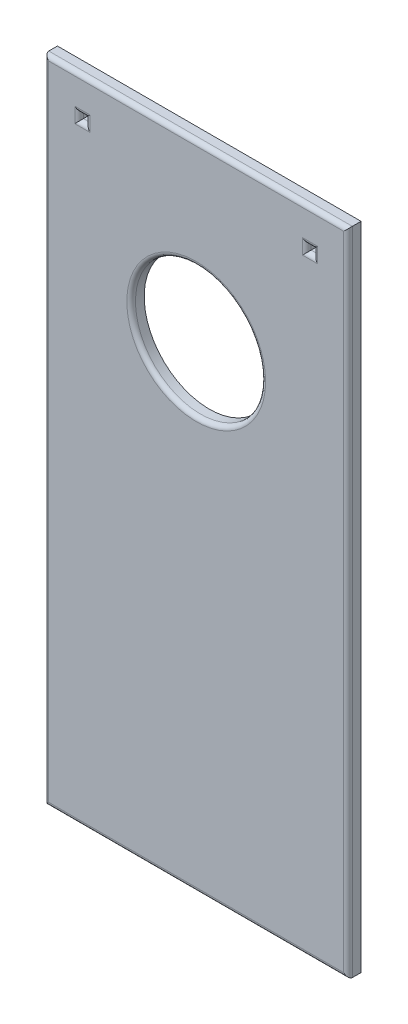
ISO-10303-21;
HEADER;
FILE_DESCRIPTION(('STEP AP214'),'2;1');
FILE_NAME('part.step','',(''),(''),'','','');
FILE_SCHEMA(('AUTOMOTIVE_DESIGN { 1 0 10303 214 1 1 1 1 }'));
ENDSEC;
DATA;
#1=APPLICATION_CONTEXT('core data for automotive mechanical design processes');
#2=APPLICATION_PROTOCOL_DEFINITION('international standard','automotive_design',2000,#1);
#3=PRODUCT_CONTEXT('',#1,'mechanical');
#4=PRODUCT('Part','Part','',(#3));
#5=PRODUCT_RELATED_PRODUCT_CATEGORY('part','',(#4));
#6=PRODUCT_DEFINITION_FORMATION('','',#4);
#7=PRODUCT_DEFINITION_CONTEXT('part definition',#1,'design');
#8=PRODUCT_DEFINITION('design','',#6,#7);
#9=PRODUCT_DEFINITION_SHAPE('','',#8);
#10=(LENGTH_UNIT() NAMED_UNIT(*) SI_UNIT(.MILLI.,.METRE.));
#11=(NAMED_UNIT(*) PLANE_ANGLE_UNIT() SI_UNIT($,.RADIAN.));
#12=(NAMED_UNIT(*) SI_UNIT($,.STERADIAN.) SOLID_ANGLE_UNIT());
#13=UNCERTAINTY_MEASURE_WITH_UNIT(LENGTH_MEASURE(1.E-05),#10,'distance_accuracy_value','');
#14=(GEOMETRIC_REPRESENTATION_CONTEXT(3) GLOBAL_UNCERTAINTY_ASSIGNED_CONTEXT((#13)) GLOBAL_UNIT_ASSIGNED_CONTEXT((#10,
#11,#12)) REPRESENTATION_CONTEXT('',''));
#15=CARTESIAN_POINT('',(0.,0.,0.));
#16=DIRECTION('',(0.,0.,1.));
#17=DIRECTION('',(1.,0.,0.));
#18=AXIS2_PLACEMENT_3D('',#15,#16,#17);
#19=CARTESIAN_POINT('',(-35.,20.,3.));
#20=DIRECTION('',(1.,0.,0.));
#21=DIRECTION('',(0.,1.,0.));
#22=AXIS2_PLACEMENT_3D('',#19,#20,#21);
#23=PLANE('',#22);
#24=DIRECTION('',(0.,0.,-1.));
#25=VECTOR('',#24,1.);
#26=CARTESIAN_POINT('',(-35.,-130.,3.));
#27=LINE('',#26,#25);
#28=CARTESIAN_POINT('',(-35.,-130.,2.));
#29=VERTEX_POINT('',#28);
#30=CARTESIAN_POINT('',(-35.,-130.,0.));
#31=VERTEX_POINT('',#30);
#32=EDGE_CURVE('E234',#29,#31,#27,.T.);
#33=ORIENTED_EDGE('',*,*,#32,.F.);
#34=DIRECTION('',(0.,-1.,0.));
#35=VECTOR('',#34,1.);
#36=CARTESIAN_POINT('',(-35.,20.,2.));
#37=LINE('',#36,#35);
#38=CARTESIAN_POINT('',(-35.,20.,2.));
#39=VERTEX_POINT('',#38);
#40=EDGE_CURVE('E273',#29,#39,#37,.F.);
#41=ORIENTED_EDGE('',*,*,#40,.T.);
#42=DIRECTION('',(0.,0.,-1.));
#43=VECTOR('',#42,1.);
#44=CARTESIAN_POINT('',(-35.,20.,3.));
#45=LINE('',#44,#43);
#46=CARTESIAN_POINT('',(-35.,20.,0.));
#47=VERTEX_POINT('',#46);
#48=EDGE_CURVE('E228',#39,#47,#45,.T.);
#49=ORIENTED_EDGE('',*,*,#48,.T.);
#50=DIRECTION('',(0.,-1.,0.));
#51=VECTOR('',#50,1.);
#52=CARTESIAN_POINT('',(-35.,20.,0.));
#53=LINE('',#52,#51);
#54=EDGE_CURVE('E216',#47,#31,#53,.T.);
#55=ORIENTED_EDGE('',*,*,#54,.T.);
#56=EDGE_LOOP('',(#33,#41,#49,#55));
#57=FACE_BOUND('',#56,.T.);
#58=ADVANCED_FACE('F31',(#57),#23,.F.);
#59=CARTESIAN_POINT('',(-35.,-130.,3.));
#60=DIRECTION('',(0.,1.,0.));
#61=DIRECTION('',(0.,0.,1.));
#62=AXIS2_PLACEMENT_3D('',#59,#60,#61);
#63=PLANE('',#62);
#64=DIRECTION('',(0.,0.,-1.));
#65=VECTOR('',#64,1.);
#66=CARTESIAN_POINT('',(35.,-130.,3.));
#67=LINE('',#66,#65);
#68=CARTESIAN_POINT('',(35.,-130.,2.));
#69=VERTEX_POINT('',#68);
#70=CARTESIAN_POINT('',(35.,-130.,0.));
#71=VERTEX_POINT('',#70);
#72=EDGE_CURVE('E232',#69,#71,#67,.T.);
#73=ORIENTED_EDGE('',*,*,#72,.F.);
#74=DIRECTION('',(1.,0.,0.));
#75=VECTOR('',#74,1.);
#76=CARTESIAN_POINT('',(-35.,-130.,2.));
#77=LINE('',#76,#75);
#78=EDGE_CURVE('E271',#69,#29,#77,.F.);
#79=ORIENTED_EDGE('',*,*,#78,.T.);
#80=ORIENTED_EDGE('',*,*,#32,.T.);
#81=DIRECTION('',(1.,0.,0.));
#82=VECTOR('',#81,1.);
#83=CARTESIAN_POINT('',(-35.,-130.,0.));
#84=LINE('',#83,#82);
#85=EDGE_CURVE('E219',#31,#71,#84,.T.);
#86=ORIENTED_EDGE('',*,*,#85,.T.);
#87=EDGE_LOOP('',(#73,#79,#80,#86));
#88=FACE_BOUND('',#87,.T.);
#89=ADVANCED_FACE('F346',(#88),#63,.F.);
#90=CARTESIAN_POINT('',(35.,20.,3.));
#91=DIRECTION('',(-1.,0.,0.));
#92=DIRECTION('',(0.,-1.,0.));
#93=AXIS2_PLACEMENT_3D('',#90,#91,#92);
#94=PLANE('',#93);
#95=DIRECTION('',(0.,0.,-1.));
#96=VECTOR('',#95,1.);
#97=CARTESIAN_POINT('',(35.,20.,3.));
#98=LINE('',#97,#96);
#99=CARTESIAN_POINT('',(35.,20.,2.));
#100=VERTEX_POINT('',#99);
#101=CARTESIAN_POINT('',(35.,20.,0.));
#102=VERTEX_POINT('',#101);
#103=EDGE_CURVE('E230',#100,#102,#98,.T.);
#104=ORIENTED_EDGE('',*,*,#103,.F.);
#105=DIRECTION('',(0.,1.,0.));
#106=VECTOR('',#105,1.);
#107=CARTESIAN_POINT('',(35.,-130.,2.));
#108=LINE('',#107,#106);
#109=EDGE_CURVE('E269',#100,#69,#108,.F.);
#110=ORIENTED_EDGE('',*,*,#109,.T.);
#111=ORIENTED_EDGE('',*,*,#72,.T.);
#112=DIRECTION('',(0.,1.,0.));
#113=VECTOR('',#112,1.);
#114=CARTESIAN_POINT('',(35.,20.,0.));
#115=LINE('',#114,#113);
#116=EDGE_CURVE('E222',#71,#102,#115,.T.);
#117=ORIENTED_EDGE('',*,*,#116,.T.);
#118=EDGE_LOOP('',(#104,#110,#111,#117));
#119=FACE_BOUND('',#118,.T.);
#120=ADVANCED_FACE('F352',(#119),#94,.F.);
#121=CARTESIAN_POINT('',(-35.,20.,3.));
#122=DIRECTION('',(0.,-1.,0.));
#123=DIRECTION('',(1.,0.,0.));
#124=AXIS2_PLACEMENT_3D('',#121,#122,#123);
#125=PLANE('',#124);
#126=ORIENTED_EDGE('',*,*,#48,.F.);
#127=DIRECTION('',(-1.,0.,0.));
#128=VECTOR('',#127,1.);
#129=CARTESIAN_POINT('',(35.,20.,2.));
#130=LINE('',#129,#128);
#131=EDGE_CURVE('E266',#39,#100,#130,.F.);
#132=ORIENTED_EDGE('',*,*,#131,.T.);
#133=ORIENTED_EDGE('',*,*,#103,.T.);
#134=DIRECTION('',(-1.,0.,0.));
#135=VECTOR('',#134,1.);
#136=CARTESIAN_POINT('',(-35.,20.,0.));
#137=LINE('',#136,#135);
#138=EDGE_CURVE('E225',#102,#47,#137,.T.);
#139=ORIENTED_EDGE('',*,*,#138,.T.);
#140=EDGE_LOOP('',(#126,#132,#133,#139));
#141=FACE_BOUND('',#140,.T.);
#142=ADVANCED_FACE('F519',(#141),#125,.F.);
#143=CARTESIAN_POINT('',(-35.,-130.,3.));
#144=DIRECTION('',(0.,0.,1.));
#145=DIRECTION('',(1.,0.,0.));
#146=AXIS2_PLACEMENT_3D('',#143,#144,#145);
#147=PLANE('',#146);
#148=DIRECTION('',(0.,1.,0.));
#149=VECTOR('',#148,1.);
#150=CARTESIAN_POINT('',(34.,20.,3.));
#151=LINE('',#150,#149);
#152=CARTESIAN_POINT('',(34.,-129.,3.));
#153=VERTEX_POINT('',#152);
#154=CARTESIAN_POINT('',(34.,19.,3.));
#155=VERTEX_POINT('',#154);
#156=EDGE_CURVE('E261',#153,#155,#151,.T.);
#157=ORIENTED_EDGE('',*,*,#156,.T.);
#158=DIRECTION('',(-1.,0.,0.));
#159=VECTOR('',#158,1.);
#160=CARTESIAN_POINT('',(-35.,19.,3.));
#161=LINE('',#160,#159);
#162=CARTESIAN_POINT('',(-34.,19.,3.));
#163=VERTEX_POINT('',#162);
#164=EDGE_CURVE('E263',#155,#163,#161,.T.);
#165=ORIENTED_EDGE('',*,*,#164,.T.);
#166=DIRECTION('',(0.,-1.,0.));
#167=VECTOR('',#166,1.);
#168=CARTESIAN_POINT('',(-34.,-130.,3.));
#169=LINE('',#168,#167);
#170=CARTESIAN_POINT('',(-34.,-129.,3.));
#171=VERTEX_POINT('',#170);
#172=EDGE_CURVE('E257',#163,#171,#169,.T.);
#173=ORIENTED_EDGE('',*,*,#172,.T.);
#174=DIRECTION('',(1.,0.,0.));
#175=VECTOR('',#174,1.);
#176=CARTESIAN_POINT('',(35.,-129.,3.));
#177=LINE('',#176,#175);
#178=EDGE_CURVE('E259',#171,#153,#177,.T.);
#179=ORIENTED_EDGE('',*,*,#178,.T.);
#180=EDGE_LOOP('',(#157,#165,#173,#179));
#181=FACE_BOUND('',#180,.T.);
#182=CARTESIAN_POINT('',(0.,-20.,3.));
#183=DIRECTION('',(0.,0.,1.));
#184=DIRECTION('',(1.,0.,0.));
#185=AXIS2_PLACEMENT_3D('',#182,#183,#184);
#186=CIRCLE('',#185,16.);
#187=CARTESIAN_POINT('',(16.,-20.,3.));
#188=VERTEX_POINT('',#187);
#189=EDGE_CURVE('E254',#188,#188,#186,.F.);
#190=ORIENTED_EDGE('',*,*,#189,.T.);
#191=EDGE_LOOP('',(#190));
#192=FACE_BOUND('',#191,.T.);
#193=DIRECTION('',(0.,1.,0.));
#194=VECTOR('',#193,1.);
#195=CARTESIAN_POINT('',(-24.5,10.5,3.));
#196=LINE('',#195,#194);
#197=CARTESIAN_POINT('',(-24.5,13.,3.));
#198=VERTEX_POINT('',#197);
#199=CARTESIAN_POINT('',(-24.5,9.50000000000001,3.));
#200=VERTEX_POINT('',#199);
#201=EDGE_CURVE('E249',#198,#200,#196,.F.);
#202=ORIENTED_EDGE('',*,*,#201,.T.);
#203=DIRECTION('',(1.,0.,0.));
#204=VECTOR('',#203,1.);
#205=CARTESIAN_POINT('',(-27.,9.50000000000001,3.));
#206=LINE('',#205,#204);
#207=CARTESIAN_POINT('',(-28.,9.50000000000001,3.));
#208=VERTEX_POINT('',#207);
#209=EDGE_CURVE('E251',#200,#208,#206,.F.);
#210=ORIENTED_EDGE('',*,*,#209,.T.);
#211=DIRECTION('',(0.,-1.,0.));
#212=VECTOR('',#211,1.);
#213=CARTESIAN_POINT('',(-28.,12.,3.));
#214=LINE('',#213,#212);
#215=CARTESIAN_POINT('',(-28.,13.,3.));
#216=VERTEX_POINT('',#215);
#217=EDGE_CURVE('E245',#208,#216,#214,.F.);
#218=ORIENTED_EDGE('',*,*,#217,.T.);
#219=DIRECTION('',(-1.,0.,0.));
#220=VECTOR('',#219,1.);
#221=CARTESIAN_POINT('',(-25.5,13.,3.));
#222=LINE('',#221,#220);
#223=EDGE_CURVE('E247',#216,#198,#222,.F.);
#224=ORIENTED_EDGE('',*,*,#223,.T.);
#225=EDGE_LOOP('',(#202,#210,#218,#224));
#226=FACE_BOUND('',#225,.T.);
#227=DIRECTION('',(0.,1.,0.));
#228=VECTOR('',#227,1.);
#229=CARTESIAN_POINT('',(28.,10.5,3.));
#230=LINE('',#229,#228);
#231=CARTESIAN_POINT('',(28.,13.,3.));
#232=VERTEX_POINT('',#231);
#233=CARTESIAN_POINT('',(28.,9.50000000000001,3.));
#234=VERTEX_POINT('',#233);
#235=EDGE_CURVE('E240',#232,#234,#230,.F.);
#236=ORIENTED_EDGE('',*,*,#235,.T.);
#237=DIRECTION('',(1.,0.,0.));
#238=VECTOR('',#237,1.);
#239=CARTESIAN_POINT('',(25.5,9.50000000000001,3.));
#240=LINE('',#239,#238);
#241=CARTESIAN_POINT('',(24.5,9.50000000000001,3.));
#242=VERTEX_POINT('',#241);
#243=EDGE_CURVE('E242',#234,#242,#240,.F.);
#244=ORIENTED_EDGE('',*,*,#243,.T.);
#245=DIRECTION('',(0.,-1.,0.));
#246=VECTOR('',#245,1.);
#247=CARTESIAN_POINT('',(24.5,12.,3.));
#248=LINE('',#247,#246);
#249=CARTESIAN_POINT('',(24.5,13.,3.));
#250=VERTEX_POINT('',#249);
#251=EDGE_CURVE('E236',#242,#250,#248,.F.);
#252=ORIENTED_EDGE('',*,*,#251,.T.);
#253=DIRECTION('',(-1.,0.,0.));
#254=VECTOR('',#253,1.);
#255=CARTESIAN_POINT('',(27.,13.,3.));
#256=LINE('',#255,#254);
#257=EDGE_CURVE('E238',#250,#232,#256,.F.);
#258=ORIENTED_EDGE('',*,*,#257,.T.);
#259=EDGE_LOOP('',(#236,#244,#252,#258));
#260=FACE_BOUND('',#259,.T.);
#261=ADVANCED_FACE('F327',(#181,#192,#226,#260),#147,.T.);
#262=CARTESIAN_POINT('',(-35.,-130.,0.));
#263=DIRECTION('',(0.,0.,1.));
#264=DIRECTION('',(1.,0.,0.));
#265=AXIS2_PLACEMENT_3D('',#262,#263,#264);
#266=PLANE('',#265);
#267=DIRECTION('',(1.,0.,0.));
#268=VECTOR('',#267,1.);
#269=CARTESIAN_POINT('',(25.5,12.,0.));
#270=LINE('',#269,#268);
#271=CARTESIAN_POINT('',(25.5,12.,0.));
#272=VERTEX_POINT('',#271);
#273=CARTESIAN_POINT('',(27.,12.,0.));
#274=VERTEX_POINT('',#273);
#275=EDGE_CURVE('E181',#272,#274,#270,.T.);
#276=ORIENTED_EDGE('',*,*,#275,.F.);
#277=DIRECTION('',(0.,1.,0.));
#278=VECTOR('',#277,1.);
#279=CARTESIAN_POINT('',(25.5,12.,0.));
#280=LINE('',#279,#278);
#281=CARTESIAN_POINT('',(25.5,10.5,0.));
#282=VERTEX_POINT('',#281);
#283=EDGE_CURVE('E161',#282,#272,#280,.T.);
#284=ORIENTED_EDGE('',*,*,#283,.F.);
#285=DIRECTION('',(-1.,0.,0.));
#286=VECTOR('',#285,1.);
#287=CARTESIAN_POINT('',(25.5,10.5,0.));
#288=LINE('',#287,#286);
#289=CARTESIAN_POINT('',(27.,10.5,0.));
#290=VERTEX_POINT('',#289);
#291=EDGE_CURVE('E171',#290,#282,#288,.T.);
#292=ORIENTED_EDGE('',*,*,#291,.F.);
#293=DIRECTION('',(0.,-1.,0.));
#294=VECTOR('',#293,1.);
#295=CARTESIAN_POINT('',(27.,12.,0.));
#296=LINE('',#295,#294);
#297=EDGE_CURVE('E183',#274,#290,#296,.T.);
#298=ORIENTED_EDGE('',*,*,#297,.F.);
#299=EDGE_LOOP('',(#276,#284,#292,#298));
#300=FACE_BOUND('',#299,.T.);
#301=DIRECTION('',(1.,0.,0.));
#302=VECTOR('',#301,1.);
#303=CARTESIAN_POINT('',(-27.,12.,0.));
#304=LINE('',#303,#302);
#305=CARTESIAN_POINT('',(-27.,12.,0.));
#306=VERTEX_POINT('',#305);
#307=CARTESIAN_POINT('',(-25.5,12.,0.));
#308=VERTEX_POINT('',#307);
#309=EDGE_CURVE('E192',#306,#308,#304,.T.);
#310=ORIENTED_EDGE('',*,*,#309,.F.);
#311=DIRECTION('',(0.,1.,0.));
#312=VECTOR('',#311,1.);
#313=CARTESIAN_POINT('',(-27.,12.,0.));
#314=LINE('',#313,#312);
#315=CARTESIAN_POINT('',(-27.,10.5,0.));
#316=VERTEX_POINT('',#315);
#317=EDGE_CURVE('E195',#316,#306,#314,.T.);
#318=ORIENTED_EDGE('',*,*,#317,.F.);
#319=DIRECTION('',(-1.,0.,0.));
#320=VECTOR('',#319,1.);
#321=CARTESIAN_POINT('',(-27.,10.5,0.));
#322=LINE('',#321,#320);
#323=CARTESIAN_POINT('',(-25.5,10.5,0.));
#324=VERTEX_POINT('',#323);
#325=EDGE_CURVE('E202',#324,#316,#322,.T.);
#326=ORIENTED_EDGE('',*,*,#325,.F.);
#327=DIRECTION('',(0.,-1.,0.));
#328=VECTOR('',#327,1.);
#329=CARTESIAN_POINT('',(-25.5,12.,0.));
#330=LINE('',#329,#328);
#331=EDGE_CURVE('E175',#308,#324,#330,.T.);
#332=ORIENTED_EDGE('',*,*,#331,.F.);
#333=EDGE_LOOP('',(#310,#318,#326,#332));
#334=FACE_BOUND('',#333,.T.);
#335=CARTESIAN_POINT('',(0.,-20.,0.));
#336=DIRECTION('',(0.,0.,1.));
#337=DIRECTION('',(1.,0.,0.));
#338=AXIS2_PLACEMENT_3D('',#335,#336,#337);
#339=CIRCLE('',#338,15.);
#340=CARTESIAN_POINT('',(15.,-20.,0.));
#341=VERTEX_POINT('',#340);
#342=EDGE_CURVE('E213',#341,#341,#339,.F.);
#343=ORIENTED_EDGE('',*,*,#342,.F.);
#344=EDGE_LOOP('',(#343));
#345=FACE_BOUND('',#344,.T.);
#346=ORIENTED_EDGE('',*,*,#54,.F.);
#347=ORIENTED_EDGE('',*,*,#138,.F.);
#348=ORIENTED_EDGE('',*,*,#116,.F.);
#349=ORIENTED_EDGE('',*,*,#85,.F.);
#350=EDGE_LOOP('',(#346,#347,#348,#349));
#351=FACE_BOUND('',#350,.T.);
#352=ADVANCED_FACE('F178',(#300,#334,#345,#351),#266,.F.);
#353=CARTESIAN_POINT('',(0.,-20.,-0.00100000000000013));
#354=DIRECTION('',(0.,0.,1.));
#355=DIRECTION('',(1.,0.,0.));
#356=AXIS2_PLACEMENT_3D('',#353,#354,#355);
#357=CYLINDRICAL_SURFACE('',#356,15.);
#358=CARTESIAN_POINT('',(0.,-20.,2.));
#359=DIRECTION('',(0.,0.,1.));
#360=DIRECTION('',(1.,0.,0.));
#361=AXIS2_PLACEMENT_3D('',#358,#359,#360);
#362=CIRCLE('',#361,15.);
#363=CARTESIAN_POINT('',(15.,-20.,2.));
#364=VERTEX_POINT('',#363);
#365=EDGE_CURVE('E275',#364,#364,#362,.T.);
#366=ORIENTED_EDGE('',*,*,#365,.T.);
#367=EDGE_LOOP('',(#366));
#368=FACE_BOUND('',#367,.T.);
#369=ORIENTED_EDGE('',*,*,#342,.T.);
#370=EDGE_LOOP('',(#369));
#371=FACE_BOUND('',#370,.T.);
#372=ADVANCED_FACE('F498',(#368,#371),#357,.F.);
#373=CARTESIAN_POINT('',(-27.,12.,-0.00100000000000013));
#374=DIRECTION('',(-1.,0.,0.));
#375=DIRECTION('',(0.,0.,1.));
#376=AXIS2_PLACEMENT_3D('',#373,#374,#375);
#377=PLANE('',#376);
#378=DIRECTION('',(0.,0.,1.));
#379=VECTOR('',#378,1.);
#380=CARTESIAN_POINT('',(-27.,12.,-0.00100000000000013));
#381=LINE('',#380,#379);
#382=CARTESIAN_POINT('',(-27.,12.,2.));
#383=VERTEX_POINT('',#382);
#384=EDGE_CURVE('E199',#306,#383,#381,.T.);
#385=ORIENTED_EDGE('',*,*,#384,.T.);
#386=DIRECTION('',(0.,-1.,0.));
#387=VECTOR('',#386,1.);
#388=CARTESIAN_POINT('',(-27.,10.5,2.));
#389=LINE('',#388,#387);
#390=CARTESIAN_POINT('',(-27.,10.5,2.));
#391=VERTEX_POINT('',#390);
#392=EDGE_CURVE('E285',#383,#391,#389,.T.);
#393=ORIENTED_EDGE('',*,*,#392,.T.);
#394=DIRECTION('',(0.,0.,1.));
#395=VECTOR('',#394,1.);
#396=CARTESIAN_POINT('',(-27.,10.5,-0.00100000000000013));
#397=LINE('',#396,#395);
#398=EDGE_CURVE('E198',#316,#391,#397,.T.);
#399=ORIENTED_EDGE('',*,*,#398,.F.);
#400=ORIENTED_EDGE('',*,*,#317,.T.);
#401=EDGE_LOOP('',(#385,#393,#399,#400));
#402=FACE_BOUND('',#401,.T.);
#403=ADVANCED_FACE('F488',(#402),#377,.F.);
#404=CARTESIAN_POINT('',(-27.,12.,-0.00100000000000013));
#405=DIRECTION('',(0.,1.,0.));
#406=DIRECTION('',(-1.,0.,0.));
#407=AXIS2_PLACEMENT_3D('',#404,#405,#406);
#408=PLANE('',#407);
#409=DIRECTION('',(0.,0.,1.));
#410=VECTOR('',#409,1.);
#411=CARTESIAN_POINT('',(-25.5,12.,-0.00100000000000013));
#412=LINE('',#411,#410);
#413=CARTESIAN_POINT('',(-25.5,12.,2.));
#414=VERTEX_POINT('',#413);
#415=EDGE_CURVE('E203',#308,#414,#412,.T.);
#416=ORIENTED_EDGE('',*,*,#415,.T.);
#417=DIRECTION('',(-1.,0.,0.));
#418=VECTOR('',#417,1.);
#419=CARTESIAN_POINT('',(-27.,12.,2.));
#420=LINE('',#419,#418);
#421=EDGE_CURVE('E283',#414,#383,#420,.T.);
#422=ORIENTED_EDGE('',*,*,#421,.T.);
#423=ORIENTED_EDGE('',*,*,#384,.F.);
#424=ORIENTED_EDGE('',*,*,#309,.T.);
#425=EDGE_LOOP('',(#416,#422,#423,#424));
#426=FACE_BOUND('',#425,.T.);
#427=ADVANCED_FACE('F478',(#426),#408,.F.);
#428=CARTESIAN_POINT('',(-25.5,12.,-0.00100000000000013));
#429=DIRECTION('',(1.,0.,0.));
#430=DIRECTION('',(0.,0.,-1.));
#431=AXIS2_PLACEMENT_3D('',#428,#429,#430);
#432=PLANE('',#431);
#433=DIRECTION('',(0.,0.,1.));
#434=VECTOR('',#433,1.);
#435=CARTESIAN_POINT('',(-25.5,10.5,-0.00100000000000013));
#436=LINE('',#435,#434);
#437=CARTESIAN_POINT('',(-25.5,10.5,2.));
#438=VERTEX_POINT('',#437);
#439=EDGE_CURVE('E206',#324,#438,#436,.T.);
#440=ORIENTED_EDGE('',*,*,#439,.T.);
#441=DIRECTION('',(0.,1.,0.));
#442=VECTOR('',#441,1.);
#443=CARTESIAN_POINT('',(-25.5,12.,2.));
#444=LINE('',#443,#442);
#445=EDGE_CURVE('E281',#438,#414,#444,.T.);
#446=ORIENTED_EDGE('',*,*,#445,.T.);
#447=ORIENTED_EDGE('',*,*,#415,.F.);
#448=ORIENTED_EDGE('',*,*,#331,.T.);
#449=EDGE_LOOP('',(#440,#446,#447,#448));
#450=FACE_BOUND('',#449,.T.);
#451=ADVANCED_FACE('F468',(#450),#432,.F.);
#452=CARTESIAN_POINT('',(-27.,10.5,-0.00100000000000013));
#453=DIRECTION('',(0.,-1.,0.));
#454=DIRECTION('',(0.,0.,-1.));
#455=AXIS2_PLACEMENT_3D('',#452,#453,#454);
#456=PLANE('',#455);
#457=ORIENTED_EDGE('',*,*,#398,.T.);
#458=DIRECTION('',(1.,0.,0.));
#459=VECTOR('',#458,1.);
#460=CARTESIAN_POINT('',(-25.5,10.5,2.));
#461=LINE('',#460,#459);
#462=EDGE_CURVE('E278',#391,#438,#461,.T.);
#463=ORIENTED_EDGE('',*,*,#462,.T.);
#464=ORIENTED_EDGE('',*,*,#439,.F.);
#465=ORIENTED_EDGE('',*,*,#325,.T.);
#466=EDGE_LOOP('',(#457,#463,#464,#465));
#467=FACE_BOUND('',#466,.T.);
#468=ADVANCED_FACE('F343',(#467),#456,.F.);
#469=CARTESIAN_POINT('',(25.5,12.,-0.00100000000000013));
#470=DIRECTION('',(-1.,0.,0.));
#471=DIRECTION('',(0.,0.,1.));
#472=AXIS2_PLACEMENT_3D('',#469,#470,#471);
#473=PLANE('',#472);
#474=DIRECTION('',(0.,0.,1.));
#475=VECTOR('',#474,1.);
#476=CARTESIAN_POINT('',(25.5,12.,-0.00100000000000013));
#477=LINE('',#476,#475);
#478=CARTESIAN_POINT('',(25.5,12.,2.));
#479=VERTEX_POINT('',#478);
#480=EDGE_CURVE('E176',#272,#479,#477,.T.);
#481=ORIENTED_EDGE('',*,*,#480,.T.);
#482=DIRECTION('',(0.,-1.,0.));
#483=VECTOR('',#482,1.);
#484=CARTESIAN_POINT('',(25.5,10.5,2.));
#485=LINE('',#484,#483);
#486=CARTESIAN_POINT('',(25.5,10.5,2.));
#487=VERTEX_POINT('',#486);
#488=EDGE_CURVE('E11',#479,#487,#485,.T.);
#489=ORIENTED_EDGE('',*,*,#488,.T.);
#490=DIRECTION('',(0.,0.,1.));
#491=VECTOR('',#490,1.);
#492=CARTESIAN_POINT('',(25.5,10.5,-0.00100000000000013));
#493=LINE('',#492,#491);
#494=EDGE_CURVE('E157',#282,#487,#493,.T.);
#495=ORIENTED_EDGE('',*,*,#494,.F.);
#496=ORIENTED_EDGE('',*,*,#283,.T.);
#497=EDGE_LOOP('',(#481,#489,#495,#496));
#498=FACE_BOUND('',#497,.T.);
#499=ADVANCED_FACE('F159',(#498),#473,.F.);
#500=CARTESIAN_POINT('',(25.5,12.,-0.00100000000000013));
#501=DIRECTION('',(0.,1.,0.));
#502=DIRECTION('',(-1.,0.,0.));
#503=AXIS2_PLACEMENT_3D('',#500,#501,#502);
#504=PLANE('',#503);
#505=DIRECTION('',(0.,0.,1.));
#506=VECTOR('',#505,1.);
#507=CARTESIAN_POINT('',(27.,12.,-0.00100000000000013));
#508=LINE('',#507,#506);
#509=CARTESIAN_POINT('',(27.,12.,2.));
#510=VERTEX_POINT('',#509);
#511=EDGE_CURVE('E188',#274,#510,#508,.T.);
#512=ORIENTED_EDGE('',*,*,#511,.T.);
#513=DIRECTION('',(-1.,0.,0.));
#514=VECTOR('',#513,1.);
#515=CARTESIAN_POINT('',(25.5,12.,2.));
#516=LINE('',#515,#514);
#517=EDGE_CURVE('E40',#510,#479,#516,.T.);
#518=ORIENTED_EDGE('',*,*,#517,.T.);
#519=ORIENTED_EDGE('',*,*,#480,.F.);
#520=ORIENTED_EDGE('',*,*,#275,.T.);
#521=EDGE_LOOP('',(#512,#518,#519,#520));
#522=FACE_BOUND('',#521,.T.);
#523=ADVANCED_FACE('F335',(#522),#504,.F.);
#524=CARTESIAN_POINT('',(27.,12.,-0.00100000000000013));
#525=DIRECTION('',(1.,0.,0.));
#526=DIRECTION('',(0.,0.,-1.));
#527=AXIS2_PLACEMENT_3D('',#524,#525,#526);
#528=PLANE('',#527);
#529=DIRECTION('',(0.,0.,1.));
#530=VECTOR('',#529,1.);
#531=CARTESIAN_POINT('',(27.,10.5,-0.00100000000000013));
#532=LINE('',#531,#530);
#533=CARTESIAN_POINT('',(27.,10.5,2.));
#534=VERTEX_POINT('',#533);
#535=EDGE_CURVE('E167',#290,#534,#532,.T.);
#536=ORIENTED_EDGE('',*,*,#535,.T.);
#537=DIRECTION('',(0.,1.,0.));
#538=VECTOR('',#537,1.);
#539=CARTESIAN_POINT('',(27.,12.,2.));
#540=LINE('',#539,#538);
#541=EDGE_CURVE('E55',#534,#510,#540,.T.);
#542=ORIENTED_EDGE('',*,*,#541,.T.);
#543=ORIENTED_EDGE('',*,*,#511,.F.);
#544=ORIENTED_EDGE('',*,*,#297,.T.);
#545=EDGE_LOOP('',(#536,#542,#543,#544));
#546=FACE_BOUND('',#545,.T.);
#547=ADVANCED_FACE('F334',(#546),#528,.F.);
#548=CARTESIAN_POINT('',(25.5,10.5,-0.00100000000000013));
#549=DIRECTION('',(0.,-1.,0.));
#550=DIRECTION('',(0.,0.,-1.));
#551=AXIS2_PLACEMENT_3D('',#548,#549,#550);
#552=PLANE('',#551);
#553=ORIENTED_EDGE('',*,*,#494,.T.);
#554=DIRECTION('',(1.,0.,0.));
#555=VECTOR('',#554,1.);
#556=CARTESIAN_POINT('',(27.,10.5,2.));
#557=LINE('',#556,#555);
#558=EDGE_CURVE('E287',#487,#534,#557,.T.);
#559=ORIENTED_EDGE('',*,*,#558,.T.);
#560=ORIENTED_EDGE('',*,*,#535,.F.);
#561=ORIENTED_EDGE('',*,*,#291,.T.);
#562=EDGE_LOOP('',(#553,#559,#560,#561));
#563=FACE_BOUND('',#562,.T.);
#564=ADVANCED_FACE('F172',(#563),#552,.F.);
#565=CARTESIAN_POINT('',(-35.,-129.,2.));
#566=DIRECTION('',(-1.,0.,0.));
#567=DIRECTION('',(0.,0.,1.));
#568=AXIS2_PLACEMENT_3D('',#565,#566,#567);
#569=CYLINDRICAL_SURFACE('',#568,1.);
#570=CARTESIAN_POINT('',(-34.,-129.,2.));
#571=DIRECTION('',(-0.707106781186548,0.707106781186547,0.));
#572=DIRECTION('',(0.707106781186547,0.707106781186548,0.));
#573=AXIS2_PLACEMENT_3D('',#570,#571,#572);
#574=ELLIPSE('',#573,1.41421356237309,1.);
#575=EDGE_CURVE('E296',#29,#171,#574,.T.);
#576=ORIENTED_EDGE('',*,*,#575,.F.);
#577=ORIENTED_EDGE('',*,*,#78,.F.);
#578=CARTESIAN_POINT('',(34.,-129.,2.));
#579=DIRECTION('',(-0.707106781186547,-0.707106781186548,0.));
#580=DIRECTION('',(-0.707106781186548,0.707106781186547,0.));
#581=AXIS2_PLACEMENT_3D('',#578,#579,#580);
#582=ELLIPSE('',#581,1.4142135623731,1.);
#583=EDGE_CURVE('E299',#153,#69,#582,.F.);
#584=ORIENTED_EDGE('',*,*,#583,.F.);
#585=ORIENTED_EDGE('',*,*,#178,.F.);
#586=EDGE_LOOP('',(#576,#577,#584,#585));
#587=FACE_BOUND('',#586,.T.);
#588=ADVANCED_FACE('F370',(#587),#569,.T.);
#589=CARTESIAN_POINT('',(34.,-130.,2.));
#590=DIRECTION('',(0.,-1.,0.));
#591=DIRECTION('',(1.,0.,0.));
#592=AXIS2_PLACEMENT_3D('',#589,#590,#591);
#593=CYLINDRICAL_SURFACE('',#592,1.);
#594=ORIENTED_EDGE('',*,*,#583,.T.);
#595=ORIENTED_EDGE('',*,*,#109,.F.);
#596=CARTESIAN_POINT('',(34.,19.,2.));
#597=DIRECTION('',(0.707106781186548,-0.707106781186547,0.));
#598=DIRECTION('',(-0.707106781186547,-0.707106781186548,0.));
#599=AXIS2_PLACEMENT_3D('',#596,#597,#598);
#600=ELLIPSE('',#599,1.41421356237309,1.);
#601=EDGE_CURVE('E293',#155,#100,#600,.F.);
#602=ORIENTED_EDGE('',*,*,#601,.F.);
#603=ORIENTED_EDGE('',*,*,#156,.F.);
#604=EDGE_LOOP('',(#594,#595,#602,#603));
#605=FACE_BOUND('',#604,.T.);
#606=ADVANCED_FACE('F366',(#605),#593,.T.);
#607=CARTESIAN_POINT('',(-34.,-130.,2.));
#608=DIRECTION('',(0.,1.,0.));
#609=DIRECTION('',(-1.,0.,0.));
#610=AXIS2_PLACEMENT_3D('',#607,#608,#609);
#611=CYLINDRICAL_SURFACE('',#610,1.);
#612=ORIENTED_EDGE('',*,*,#575,.T.);
#613=ORIENTED_EDGE('',*,*,#172,.F.);
#614=CARTESIAN_POINT('',(-34.,19.,2.));
#615=DIRECTION('',(0.707106781186547,0.707106781186548,0.));
#616=DIRECTION('',(-0.707106781186548,0.707106781186547,0.));
#617=AXIS2_PLACEMENT_3D('',#614,#615,#616);
#618=ELLIPSE('',#617,1.41421356237309,1.);
#619=EDGE_CURVE('E291',#39,#163,#618,.T.);
#620=ORIENTED_EDGE('',*,*,#619,.F.);
#621=ORIENTED_EDGE('',*,*,#40,.F.);
#622=EDGE_LOOP('',(#612,#613,#620,#621));
#623=FACE_BOUND('',#622,.T.);
#624=ADVANCED_FACE('F362',(#623),#611,.T.);
#625=CARTESIAN_POINT('',(-35.,19.,2.));
#626=DIRECTION('',(1.,0.,0.));
#627=DIRECTION('',(0.,1.,0.));
#628=AXIS2_PLACEMENT_3D('',#625,#626,#627);
#629=CYLINDRICAL_SURFACE('',#628,1.);
#630=ORIENTED_EDGE('',*,*,#601,.T.);
#631=ORIENTED_EDGE('',*,*,#131,.F.);
#632=ORIENTED_EDGE('',*,*,#619,.T.);
#633=ORIENTED_EDGE('',*,*,#164,.F.);
#634=EDGE_LOOP('',(#630,#631,#632,#633));
#635=FACE_BOUND('',#634,.T.);
#636=ADVANCED_FACE('F358',(#635),#629,.T.);
#637=CARTESIAN_POINT('',(0.,-20.,2.));
#638=DIRECTION('',(0.,0.,1.));
#639=DIRECTION('',(1.,0.,0.));
#640=AXIS2_PLACEMENT_3D('',#637,#638,#639);
#641=TOROIDAL_SURFACE('',#640,16.,1.);
#642=ORIENTED_EDGE('',*,*,#189,.F.);
#643=EDGE_LOOP('',(#642));
#644=FACE_BOUND('',#643,.T.);
#645=ORIENTED_EDGE('',*,*,#365,.F.);
#646=EDGE_LOOP('',(#645));
#647=FACE_BOUND('',#646,.T.);
#648=ADVANCED_FACE('F361',(#644,#647),#641,.T.);
#649=CARTESIAN_POINT('',(-27.,13.,2.));
#650=DIRECTION('',(1.,0.,0.));
#651=DIRECTION('',(0.,1.,0.));
#652=AXIS2_PLACEMENT_3D('',#649,#650,#651);
#653=CYLINDRICAL_SURFACE('',#652,1.);
#654=CARTESIAN_POINT('',(-24.5,13.,2.));
#655=DIRECTION('',(0.707106781186547,-0.707106781186548,0.));
#656=DIRECTION('',(-0.707106781186548,-0.707106781186547,0.));
#657=AXIS2_PLACEMENT_3D('',#654,#655,#656);
#658=ELLIPSE('',#657,1.41421356237309,1.);
#659=EDGE_CURVE('E306',#198,#414,#658,.T.);
#660=ORIENTED_EDGE('',*,*,#659,.F.);
#661=ORIENTED_EDGE('',*,*,#223,.F.);
#662=CARTESIAN_POINT('',(-28.,13.,2.));
#663=DIRECTION('',(0.707106781186548,0.707106781186547,0.));
#664=DIRECTION('',(0.707106781186547,-0.707106781186548,0.));
#665=AXIS2_PLACEMENT_3D('',#662,#663,#664);
#666=ELLIPSE('',#665,1.4142135623731,1.);
#667=EDGE_CURVE('E294',#383,#216,#666,.F.);
#668=ORIENTED_EDGE('',*,*,#667,.F.);
#669=ORIENTED_EDGE('',*,*,#421,.F.);
#670=EDGE_LOOP('',(#660,#661,#668,#669));
#671=FACE_BOUND('',#670,.T.);
#672=ADVANCED_FACE('F377',(#671),#653,.T.);
#673=CARTESIAN_POINT('',(-28.,12.,2.));
#674=DIRECTION('',(0.,1.,0.));
#675=DIRECTION('',(0.,0.,1.));
#676=AXIS2_PLACEMENT_3D('',#673,#674,#675);
#677=CYLINDRICAL_SURFACE('',#676,1.);
#678=ORIENTED_EDGE('',*,*,#667,.T.);
#679=ORIENTED_EDGE('',*,*,#217,.F.);
#680=CARTESIAN_POINT('',(-28.,9.50000000000001,2.));
#681=DIRECTION('',(-0.707106781186547,0.707106781186547,0.));
#682=DIRECTION('',(-0.707106781186547,-0.707106781186547,0.));
#683=AXIS2_PLACEMENT_3D('',#680,#681,#682);
#684=ELLIPSE('',#683,1.41421356237309,1.);
#685=EDGE_CURVE('E304',#391,#208,#684,.F.);
#686=ORIENTED_EDGE('',*,*,#685,.F.);
#687=ORIENTED_EDGE('',*,*,#392,.F.);
#688=EDGE_LOOP('',(#678,#679,#686,#687));
#689=FACE_BOUND('',#688,.T.);
#690=ADVANCED_FACE('F386',(#689),#677,.T.);
#691=CARTESIAN_POINT('',(-24.5,12.,2.));
#692=DIRECTION('',(0.,-1.,0.));
#693=DIRECTION('',(0.,0.,-1.));
#694=AXIS2_PLACEMENT_3D('',#691,#692,#693);
#695=CYLINDRICAL_SURFACE('',#694,1.);
#696=ORIENTED_EDGE('',*,*,#659,.T.);
#697=ORIENTED_EDGE('',*,*,#445,.F.);
#698=CARTESIAN_POINT('',(-24.5,9.50000000000001,2.));
#699=DIRECTION('',(-0.707106781186547,-0.707106781186547,0.));
#700=DIRECTION('',(-0.707106781186547,0.707106781186547,0.));
#701=AXIS2_PLACEMENT_3D('',#698,#699,#700);
#702=ELLIPSE('',#701,1.41421356237309,1.);
#703=EDGE_CURVE('E302',#200,#438,#702,.T.);
#704=ORIENTED_EDGE('',*,*,#703,.F.);
#705=ORIENTED_EDGE('',*,*,#201,.F.);
#706=EDGE_LOOP('',(#696,#697,#704,#705));
#707=FACE_BOUND('',#706,.T.);
#708=ADVANCED_FACE('F382',(#707),#695,.T.);
#709=CARTESIAN_POINT('',(-27.,9.50000000000001,2.));
#710=DIRECTION('',(-1.,0.,0.));
#711=DIRECTION('',(0.,0.,1.));
#712=AXIS2_PLACEMENT_3D('',#709,#710,#711);
#713=CYLINDRICAL_SURFACE('',#712,1.);
#714=ORIENTED_EDGE('',*,*,#685,.T.);
#715=ORIENTED_EDGE('',*,*,#209,.F.);
#716=ORIENTED_EDGE('',*,*,#703,.T.);
#717=ORIENTED_EDGE('',*,*,#462,.F.);
#718=EDGE_LOOP('',(#714,#715,#716,#717));
#719=FACE_BOUND('',#718,.T.);
#720=ADVANCED_FACE('F379',(#719),#713,.T.);
#721=CARTESIAN_POINT('',(25.5,13.,2.));
#722=DIRECTION('',(1.,0.,0.));
#723=DIRECTION('',(0.,1.,0.));
#724=AXIS2_PLACEMENT_3D('',#721,#722,#723);
#725=CYLINDRICAL_SURFACE('',#724,1.);
#726=CARTESIAN_POINT('',(28.,13.,2.));
#727=DIRECTION('',(0.707106781186548,-0.707106781186547,0.));
#728=DIRECTION('',(-0.707106781186547,-0.707106781186548,0.));
#729=AXIS2_PLACEMENT_3D('',#726,#727,#728);
#730=ELLIPSE('',#729,1.4142135623731,1.);
#731=EDGE_CURVE('E314',#232,#510,#730,.T.);
#732=ORIENTED_EDGE('',*,*,#731,.F.);
#733=ORIENTED_EDGE('',*,*,#257,.F.);
#734=CARTESIAN_POINT('',(24.5,13.,2.));
#735=DIRECTION('',(0.707106781186547,0.707106781186548,0.));
#736=DIRECTION('',(0.707106781186548,-0.707106781186547,0.));
#737=AXIS2_PLACEMENT_3D('',#734,#735,#736);
#738=ELLIPSE('',#737,1.41421356237309,1.);
#739=EDGE_CURVE('E35',#479,#250,#738,.F.);
#740=ORIENTED_EDGE('',*,*,#739,.F.);
#741=ORIENTED_EDGE('',*,*,#517,.F.);
#742=EDGE_LOOP('',(#732,#733,#740,#741));
#743=FACE_BOUND('',#742,.T.);
#744=ADVANCED_FACE('F33',(#743),#725,.T.);
#745=CARTESIAN_POINT('',(24.5,12.,2.));
#746=DIRECTION('',(0.,1.,0.));
#747=DIRECTION('',(0.,0.,1.));
#748=AXIS2_PLACEMENT_3D('',#745,#746,#747);
#749=CYLINDRICAL_SURFACE('',#748,1.);
#750=ORIENTED_EDGE('',*,*,#739,.T.);
#751=ORIENTED_EDGE('',*,*,#251,.F.);
#752=CARTESIAN_POINT('',(24.5,9.50000000000001,2.));
#753=DIRECTION('',(-0.707106781186547,0.707106781186547,0.));
#754=DIRECTION('',(-0.707106781186547,-0.707106781186547,0.));
#755=AXIS2_PLACEMENT_3D('',#752,#753,#754);
#756=ELLIPSE('',#755,1.41421356237309,1.);
#757=EDGE_CURVE('E313',#487,#242,#756,.F.);
#758=ORIENTED_EDGE('',*,*,#757,.F.);
#759=ORIENTED_EDGE('',*,*,#488,.F.);
#760=EDGE_LOOP('',(#750,#751,#758,#759));
#761=FACE_BOUND('',#760,.T.);
#762=ADVANCED_FACE('F323',(#761),#749,.T.);
#763=CARTESIAN_POINT('',(28.,12.,2.));
#764=DIRECTION('',(0.,-1.,0.));
#765=DIRECTION('',(0.,0.,-1.));
#766=AXIS2_PLACEMENT_3D('',#763,#764,#765);
#767=CYLINDRICAL_SURFACE('',#766,1.);
#768=ORIENTED_EDGE('',*,*,#731,.T.);
#769=ORIENTED_EDGE('',*,*,#541,.F.);
#770=CARTESIAN_POINT('',(28.,9.50000000000001,2.));
#771=DIRECTION('',(-0.707106781186547,-0.707106781186547,0.));
#772=DIRECTION('',(-0.707106781186547,0.707106781186547,0.));
#773=AXIS2_PLACEMENT_3D('',#770,#771,#772);
#774=ELLIPSE('',#773,1.41421356237309,1.);
#775=EDGE_CURVE('E311',#234,#534,#774,.T.);
#776=ORIENTED_EDGE('',*,*,#775,.F.);
#777=ORIENTED_EDGE('',*,*,#235,.F.);
#778=EDGE_LOOP('',(#768,#769,#776,#777));
#779=FACE_BOUND('',#778,.T.);
#780=ADVANCED_FACE('F333',(#779),#767,.T.);
#781=CARTESIAN_POINT('',(25.5,9.50000000000001,2.));
#782=DIRECTION('',(-1.,0.,0.));
#783=DIRECTION('',(0.,0.,1.));
#784=AXIS2_PLACEMENT_3D('',#781,#782,#783);
#785=CYLINDRICAL_SURFACE('',#784,1.);
#786=ORIENTED_EDGE('',*,*,#757,.T.);
#787=ORIENTED_EDGE('',*,*,#243,.F.);
#788=ORIENTED_EDGE('',*,*,#775,.T.);
#789=ORIENTED_EDGE('',*,*,#558,.F.);
#790=EDGE_LOOP('',(#786,#787,#788,#789));
#791=FACE_BOUND('',#790,.T.);
#792=ADVANCED_FACE('F331',(#791),#785,.T.);
#793=CLOSED_SHELL('',(#58,#89,#120,#142,#261,#352,#372,#403,#427,#451,#468,#499,#523,#547,#564,
#588,#606,#624,#636,#648,#672,#690,#708,#720,#744,#762,#780,#792));
#794=MANIFOLD_SOLID_BREP('B2',#793);
#795=ADVANCED_BREP_SHAPE_REPRESENTATION('',(#18,#794),#14);
#796=SHAPE_DEFINITION_REPRESENTATION(#9,#795);
ENDSEC;
END-ISO-10303-21;
